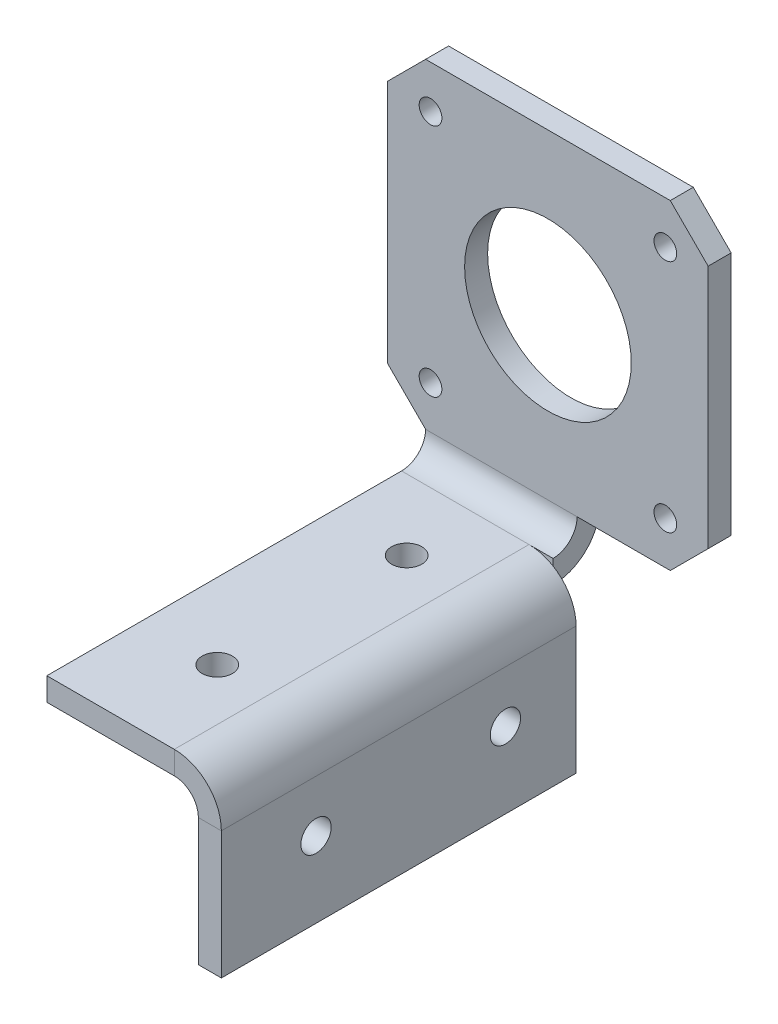
ISO-10303-21;
HEADER;
FILE_DESCRIPTION(('STEP AP214'),'2;1');
FILE_NAME('part.step','',(''),(''),'','','');
FILE_SCHEMA(('AUTOMOTIVE_DESIGN { 1 0 10303 214 1 1 1 1 }'));
ENDSEC;
DATA;
#1=APPLICATION_CONTEXT('core data for automotive mechanical design processes');
#2=APPLICATION_PROTOCOL_DEFINITION('international standard','automotive_design',2000,#1);
#3=PRODUCT_CONTEXT('',#1,'mechanical');
#4=PRODUCT('Part','Part','',(#3));
#5=PRODUCT_RELATED_PRODUCT_CATEGORY('part','',(#4));
#6=PRODUCT_DEFINITION_FORMATION('','',#4);
#7=PRODUCT_DEFINITION_CONTEXT('part definition',#1,'design');
#8=PRODUCT_DEFINITION('design','',#6,#7);
#9=PRODUCT_DEFINITION_SHAPE('','',#8);
#10=(LENGTH_UNIT() NAMED_UNIT(*) SI_UNIT(.MILLI.,.METRE.));
#11=(NAMED_UNIT(*) PLANE_ANGLE_UNIT() SI_UNIT($,.RADIAN.));
#12=(NAMED_UNIT(*) SI_UNIT($,.STERADIAN.) SOLID_ANGLE_UNIT());
#13=UNCERTAINTY_MEASURE_WITH_UNIT(LENGTH_MEASURE(1.E-05),#10,'distance_accuracy_value','');
#14=(GEOMETRIC_REPRESENTATION_CONTEXT(3) GLOBAL_UNCERTAINTY_ASSIGNED_CONTEXT((#13)) GLOBAL_UNIT_ASSIGNED_CONTEXT((#10,
#11,#12)) REPRESENTATION_CONTEXT('',''));
#15=CARTESIAN_POINT('',(0.,0.,0.));
#16=DIRECTION('',(0.,0.,1.));
#17=DIRECTION('',(1.,0.,0.));
#18=AXIS2_PLACEMENT_3D('',#15,#16,#17);
#19=CARTESIAN_POINT('',(31.1366708785734,0.564613687180432,3.17499999999998));
#20=DIRECTION('',(0.,0.,1.));
#21=DIRECTION('',(0.,-1.,0.));
#22=AXIS2_PLACEMENT_3D('',#19,#20,#21);
#23=PLANE('',#22);
#24=DIRECTION('',(1.,0.,0.));
#25=VECTOR('',#24,1.);
#26=CARTESIAN_POINT('',(14.3116708785734,3.60245368718043,3.17499999999999));
#27=LINE('',#26,#25);
#28=CARTESIAN_POINT('',(31.1366708785734,3.60245368718043,3.17499999999999));
#29=VERTEX_POINT('',#28);
#30=CARTESIAN_POINT('',(34.3116708785734,3.60245368718043,3.17499999999999));
#31=VERTEX_POINT('',#30);
#32=EDGE_CURVE('E297',#29,#31,#27,.T.);
#33=ORIENTED_EDGE('',*,*,#32,.F.);
#34=CARTESIAN_POINT('',(31.1366708785734,-2.61038631281957,3.17499999999997));
#35=DIRECTION('',(0.,0.,1.));
#36=DIRECTION('',(0.,-1.,0.));
#37=AXIS2_PLACEMENT_3D('',#34,#35,#36);
#38=CIRCLE('',#37,6.21284);
#39=CARTESIAN_POINT('',(34.3116708785734,2.72990917203893,3.17499999999999));
#40=VERTEX_POINT('',#39);
#41=EDGE_CURVE('E253',#29,#40,#38,.F.);
#42=ORIENTED_EDGE('',*,*,#41,.T.);
#43=DIRECTION('',(0.,1.,0.));
#44=VECTOR('',#43,1.);
#45=CARTESIAN_POINT('',(34.3116708785734,3.60245368718043,3.17499999999999));
#46=LINE('',#45,#44);
#47=EDGE_CURVE('E290',#31,#40,#46,.F.);
#48=ORIENTED_EDGE('',*,*,#47,.F.);
#49=EDGE_LOOP('',(#33,#42,#48));
#50=FACE_BOUND('',#49,.T.);
#51=ADVANCED_FACE('F57',(#50),#23,.T.);
#52=CARTESIAN_POINT('',(0.,0.564613687180438,0.));
#53=DIRECTION('',(0.,1.,0.));
#54=DIRECTION('',(0.,0.,1.));
#55=AXIS2_PLACEMENT_3D('',#52,#53,#54);
#56=PLANE('',#55);
#57=CARTESIAN_POINT('',(24.3116708785734,0.564613687180394,12.5));
#58=DIRECTION('',(0.,1.,0.));
#59=DIRECTION('',(0.,0.,1.));
#60=AXIS2_PLACEMENT_3D('',#57,#58,#59);
#61=CIRCLE('',#60,2.);
#62=CARTESIAN_POINT('',(24.3116708785734,0.564613687180388,14.5));
#63=VERTEX_POINT('',#62);
#64=EDGE_CURVE('E850',#63,#63,#61,.T.);
#65=ORIENTED_EDGE('',*,*,#64,.T.);
#66=EDGE_LOOP('',(#65));
#67=FACE_BOUND('',#66,.T.);
#68=CARTESIAN_POINT('',(24.3116708785734,0.564613687180307,37.5));
#69=DIRECTION('',(0.,1.,0.));
#70=DIRECTION('',(0.,0.,1.));
#71=AXIS2_PLACEMENT_3D('',#68,#69,#70);
#72=CIRCLE('',#71,2.);
#73=CARTESIAN_POINT('',(24.3116708785734,0.5646136871803,39.5));
#74=VERTEX_POINT('',#73);
#75=EDGE_CURVE('E854',#74,#74,#72,.T.);
#76=ORIENTED_EDGE('',*,*,#75,.T.);
#77=EDGE_LOOP('',(#76));
#78=FACE_BOUND('',#77,.T.);
#79=DIRECTION('',(0.,0.,1.));
#80=VECTOR('',#79,1.);
#81=CARTESIAN_POINT('',(31.1366708785734,0.564613687180269,50.));
#82=LINE('',#81,#80);
#83=CARTESIAN_POINT('',(31.1366708785734,0.564613687180269,50.));
#84=VERTEX_POINT('',#83);
#85=CARTESIAN_POINT('',(31.1366708785734,0.564613687180432,3.17499999999998));
#86=VERTEX_POINT('',#85);
#87=EDGE_CURVE('E262',#84,#86,#82,.F.);
#88=ORIENTED_EDGE('',*,*,#87,.F.);
#89=DIRECTION('',(-1.,0.,0.));
#90=VECTOR('',#89,1.);
#91=CARTESIAN_POINT('',(0.,0.564613687180264,50.));
#92=LINE('',#91,#90);
#93=CARTESIAN_POINT('',(14.3116708785734,0.564613687180264,50.));
#94=VERTEX_POINT('',#93);
#95=EDGE_CURVE('E277',#84,#94,#92,.T.);
#96=ORIENTED_EDGE('',*,*,#95,.T.);
#97=DIRECTION('',(0.,0.,-1.));
#98=VECTOR('',#97,1.);
#99=CARTESIAN_POINT('',(14.3116708785734,0.564613687180438,0.));
#100=LINE('',#99,#98);
#101=CARTESIAN_POINT('',(14.3116708785734,0.564613687180427,3.17499999999998));
#102=VERTEX_POINT('',#101);
#103=EDGE_CURVE('E274',#94,#102,#100,.T.);
#104=ORIENTED_EDGE('',*,*,#103,.T.);
#105=DIRECTION('',(1.,0.,0.));
#106=VECTOR('',#105,1.);
#107=CARTESIAN_POINT('',(14.3116708785734,0.564613687180427,3.17499999999998));
#108=LINE('',#107,#106);
#109=EDGE_CURVE('E289',#86,#102,#108,.F.);
#110=ORIENTED_EDGE('',*,*,#109,.F.);
#111=EDGE_LOOP('',(#88,#96,#104,#110));
#112=FACE_BOUND('',#111,.T.);
#113=ADVANCED_FACE('F378',(#67,#78,#112),#56,.F.);
#114=CARTESIAN_POINT('',(0.,3.60245368718044,0.));
#115=DIRECTION('',(0.,1.,0.));
#116=DIRECTION('',(0.,0.,1.));
#117=AXIS2_PLACEMENT_3D('',#114,#115,#116);
#118=PLANE('',#117);
#119=CARTESIAN_POINT('',(24.3116708785734,3.60245368718039,12.5));
#120=DIRECTION('',(0.,1.,0.));
#121=DIRECTION('',(0.,0.,1.));
#122=AXIS2_PLACEMENT_3D('',#119,#120,#121);
#123=CIRCLE('',#122,2.);
#124=CARTESIAN_POINT('',(24.3116708785734,3.60245368718039,14.5));
#125=VERTEX_POINT('',#124);
#126=EDGE_CURVE('E847',#125,#125,#123,.T.);
#127=ORIENTED_EDGE('',*,*,#126,.F.);
#128=EDGE_LOOP('',(#127));
#129=FACE_BOUND('',#128,.T.);
#130=CARTESIAN_POINT('',(24.3116708785734,3.60245368718031,37.5));
#131=DIRECTION('',(0.,1.,0.));
#132=DIRECTION('',(0.,0.,1.));
#133=AXIS2_PLACEMENT_3D('',#130,#131,#132);
#134=CIRCLE('',#133,2.);
#135=CARTESIAN_POINT('',(24.3116708785734,3.6024536871803,39.5));
#136=VERTEX_POINT('',#135);
#137=EDGE_CURVE('E851',#136,#136,#134,.T.);
#138=ORIENTED_EDGE('',*,*,#137,.F.);
#139=EDGE_LOOP('',(#138));
#140=FACE_BOUND('',#139,.T.);
#141=DIRECTION('',(1.,0.,0.));
#142=VECTOR('',#141,1.);
#143=CARTESIAN_POINT('',(14.3116708785734,3.60245368718026,50.));
#144=LINE('',#143,#142);
#145=CARTESIAN_POINT('',(31.1366708785734,3.60245368718027,50.));
#146=VERTEX_POINT('',#145);
#147=CARTESIAN_POINT('',(14.3116708785734,3.60245368718026,50.));
#148=VERTEX_POINT('',#147);
#149=EDGE_CURVE('E283',#146,#148,#144,.F.);
#150=ORIENTED_EDGE('',*,*,#149,.F.);
#151=DIRECTION('',(0.,0.,1.));
#152=VECTOR('',#151,1.);
#153=CARTESIAN_POINT('',(31.1366708785734,3.60245368718027,50.));
#154=LINE('',#153,#152);
#155=EDGE_CURVE('E248',#146,#29,#154,.F.);
#156=ORIENTED_EDGE('',*,*,#155,.T.);
#157=CARTESIAN_POINT('',(14.3116708785734,3.60245368718043,3.17499999999999));
#158=VERTEX_POINT('',#157);
#159=EDGE_CURVE('E294',#158,#29,#27,.T.);
#160=ORIENTED_EDGE('',*,*,#159,.F.);
#161=DIRECTION('',(0.,0.,1.));
#162=VECTOR('',#161,1.);
#163=CARTESIAN_POINT('',(14.3116708785734,3.60245368718044,0.));
#164=LINE('',#163,#162);
#165=EDGE_CURVE('E280',#148,#158,#164,.F.);
#166=ORIENTED_EDGE('',*,*,#165,.F.);
#167=EDGE_LOOP('',(#150,#156,#160,#166));
#168=FACE_BOUND('',#167,.T.);
#169=ADVANCED_FACE('F391',(#129,#140,#168),#118,.T.);
#170=CARTESIAN_POINT('',(14.3116708785734,0.564613687180264,50.));
#171=DIRECTION('',(0.,0.,-1.));
#172=DIRECTION('',(0.,1.,0.));
#173=AXIS2_PLACEMENT_3D('',#170,#171,#172);
#174=PLANE('',#173);
#175=DIRECTION('',(0.,1.,0.));
#176=VECTOR('',#175,1.);
#177=CARTESIAN_POINT('',(31.1366708785734,0.564613687180269,50.));
#178=LINE('',#177,#176);
#179=EDGE_CURVE('E256',#84,#146,#178,.T.);
#180=ORIENTED_EDGE('',*,*,#179,.T.);
#181=ORIENTED_EDGE('',*,*,#149,.T.);
#182=DIRECTION('',(0.,1.,0.));
#183=VECTOR('',#182,1.);
#184=CARTESIAN_POINT('',(14.3116708785734,0.564613687180263,50.));
#185=LINE('',#184,#183);
#186=EDGE_CURVE('E270',#94,#148,#185,.T.);
#187=ORIENTED_EDGE('',*,*,#186,.F.);
#188=ORIENTED_EDGE('',*,*,#95,.F.);
#189=EDGE_LOOP('',(#180,#181,#187,#188));
#190=FACE_BOUND('',#189,.T.);
#191=ADVANCED_FACE('F386',(#190),#174,.F.);
#192=CARTESIAN_POINT('',(34.3116708785734,6.77745368718043,-3.03784));
#193=DIRECTION('',(0.,-1.,0.));
#194=DIRECTION('',(0.,0.,-1.));
#195=AXIS2_PLACEMENT_3D('',#192,#193,#194);
#196=PLANE('',#195);
#197=DIRECTION('',(1.,0.,0.));
#198=VECTOR('',#197,1.);
#199=CARTESIAN_POINT('',(34.3116708785734,6.77745368718043,0.));
#200=LINE('',#199,#198);
#201=CARTESIAN_POINT('',(34.3116708785734,6.77745368718043,0.));
#202=VERTEX_POINT('',#201);
#203=CARTESIAN_POINT('',(46.6116708785734,6.77745368718043,0.));
#204=VERTEX_POINT('',#203);
#205=EDGE_CURVE('E177',#202,#204,#200,.T.);
#206=ORIENTED_EDGE('',*,*,#205,.F.);
#207=DIRECTION('',(0.,0.,-1.));
#208=VECTOR('',#207,1.);
#209=CARTESIAN_POINT('',(34.3116708785734,6.77745368718043,0.));
#210=LINE('',#209,#208);
#211=CARTESIAN_POINT('',(34.3116708785734,6.77745368718043,-3.03784));
#212=VERTEX_POINT('',#211);
#213=EDGE_CURVE('E303',#202,#212,#210,.T.);
#214=ORIENTED_EDGE('',*,*,#213,.T.);
#215=DIRECTION('',(1.,0.,0.));
#216=VECTOR('',#215,1.);
#217=CARTESIAN_POINT('',(14.3116708785734,6.77745368718043,-3.03784));
#218=LINE('',#217,#216);
#219=CARTESIAN_POINT('',(46.6116708785734,6.77745368718043,-3.03784));
#220=VERTEX_POINT('',#219);
#221=EDGE_CURVE('E159',#212,#220,#218,.T.);
#222=ORIENTED_EDGE('',*,*,#221,.T.);
#223=DIRECTION('',(0.,0.,1.));
#224=VECTOR('',#223,1.);
#225=CARTESIAN_POINT('',(46.6116708785734,6.77745368718043,-3.03784));
#226=LINE('',#225,#224);
#227=EDGE_CURVE('E145',#220,#204,#226,.T.);
#228=ORIENTED_EDGE('',*,*,#227,.T.);
#229=EDGE_LOOP('',(#206,#214,#222,#228));
#230=FACE_BOUND('',#229,.T.);
#231=ADVANCED_FACE('F352',(#230),#196,.T.);
#232=CARTESIAN_POINT('',(14.3116708785734,49.0774536871804,-3.03784));
#233=DIRECTION('',(0.,1.,0.));
#234=DIRECTION('',(0.,0.,1.));
#235=AXIS2_PLACEMENT_3D('',#232,#233,#234);
#236=PLANE('',#235);
#237=DIRECTION('',(-1.,0.,0.));
#238=VECTOR('',#237,1.);
#239=CARTESIAN_POINT('',(14.3116708785734,49.0774536871804,0.));
#240=LINE('',#239,#238);
#241=CARTESIAN_POINT('',(46.6116708785734,49.0774536871804,0.));
#242=VERTEX_POINT('',#241);
#243=CARTESIAN_POINT('',(14.3116708785734,49.0774536871804,0.));
#244=VERTEX_POINT('',#243);
#245=EDGE_CURVE('E164',#242,#244,#240,.T.);
#246=ORIENTED_EDGE('',*,*,#245,.F.);
#247=DIRECTION('',(0.,0.,1.));
#248=VECTOR('',#247,1.);
#249=CARTESIAN_POINT('',(46.6116708785734,49.0774536871804,-3.03784));
#250=LINE('',#249,#248);
#251=CARTESIAN_POINT('',(46.6116708785734,49.0774536871804,-3.03784));
#252=VERTEX_POINT('',#251);
#253=EDGE_CURVE('E13',#252,#242,#250,.T.);
#254=ORIENTED_EDGE('',*,*,#253,.F.);
#255=DIRECTION('',(-1.,0.,0.));
#256=VECTOR('',#255,1.);
#257=CARTESIAN_POINT('',(14.3116708785734,49.0774536871804,-3.03784));
#258=LINE('',#257,#256);
#259=CARTESIAN_POINT('',(14.3116708785734,49.0774536871804,-3.03784));
#260=VERTEX_POINT('',#259);
#261=EDGE_CURVE('E186',#252,#260,#258,.T.);
#262=ORIENTED_EDGE('',*,*,#261,.T.);
#263=DIRECTION('',(0.,0.,1.));
#264=VECTOR('',#263,1.);
#265=CARTESIAN_POINT('',(14.3116708785734,49.0774536871804,-3.03784));
#266=LINE('',#265,#264);
#267=EDGE_CURVE('E117',#260,#244,#266,.T.);
#268=ORIENTED_EDGE('',*,*,#267,.T.);
#269=EDGE_LOOP('',(#246,#254,#262,#268));
#270=FACE_BOUND('',#269,.T.);
#271=ADVANCED_FACE('F59',(#270),#236,.T.);
#272=CARTESIAN_POINT('',(46.6116708785734,49.0774536871804,-3.03784));
#273=DIRECTION('',(0.707106781186548,0.707106781186547,0.));
#274=DIRECTION('',(-0.707106781186547,0.707106781186548,0.));
#275=AXIS2_PLACEMENT_3D('',#272,#273,#274);
#276=PLANE('',#275);
#277=DIRECTION('',(-0.707106781186547,0.707106781186548,0.));
#278=VECTOR('',#277,1.);
#279=CARTESIAN_POINT('',(46.6116708785734,49.0774536871804,0.));
#280=LINE('',#279,#278);
#281=CARTESIAN_POINT('',(51.6116708785734,44.0774536871804,0.));
#282=VERTEX_POINT('',#281);
#283=EDGE_CURVE('E184',#282,#242,#280,.T.);
#284=ORIENTED_EDGE('',*,*,#283,.F.);
#285=DIRECTION('',(0.,0.,1.));
#286=VECTOR('',#285,1.);
#287=CARTESIAN_POINT('',(51.6116708785734,44.0774536871804,-3.03784));
#288=LINE('',#287,#286);
#289=CARTESIAN_POINT('',(51.6116708785734,44.0774536871804,-3.03784));
#290=VERTEX_POINT('',#289);
#291=EDGE_CURVE('E66',#290,#282,#288,.T.);
#292=ORIENTED_EDGE('',*,*,#291,.F.);
#293=DIRECTION('',(-0.707106781186547,0.707106781186548,0.));
#294=VECTOR('',#293,1.);
#295=CARTESIAN_POINT('',(46.6116708785734,49.0774536871804,-3.03784));
#296=LINE('',#295,#294);
#297=EDGE_CURVE('E152',#290,#252,#296,.T.);
#298=ORIENTED_EDGE('',*,*,#297,.T.);
#299=ORIENTED_EDGE('',*,*,#253,.T.);
#300=EDGE_LOOP('',(#284,#292,#298,#299));
#301=FACE_BOUND('',#300,.T.);
#302=ADVANCED_FACE('F428',(#301),#276,.T.);
#303=CARTESIAN_POINT('',(51.6116708785734,11.7774536871804,-3.03784));
#304=DIRECTION('',(1.,0.,0.));
#305=DIRECTION('',(0.,0.,-1.));
#306=AXIS2_PLACEMENT_3D('',#303,#304,#305);
#307=PLANE('',#306);
#308=DIRECTION('',(0.,1.,0.));
#309=VECTOR('',#308,1.);
#310=CARTESIAN_POINT('',(51.6116708785734,11.7774536871804,0.));
#311=LINE('',#310,#309);
#312=CARTESIAN_POINT('',(51.6116708785734,11.7774536871804,0.));
#313=VERTEX_POINT('',#312);
#314=EDGE_CURVE('E140',#313,#282,#311,.T.);
#315=ORIENTED_EDGE('',*,*,#314,.F.);
#316=DIRECTION('',(0.,0.,1.));
#317=VECTOR('',#316,1.);
#318=CARTESIAN_POINT('',(51.6116708785734,11.7774536871804,-3.03784));
#319=LINE('',#318,#317);
#320=CARTESIAN_POINT('',(51.6116708785734,11.7774536871804,-3.03784));
#321=VERTEX_POINT('',#320);
#322=EDGE_CURVE('E134',#321,#313,#319,.T.);
#323=ORIENTED_EDGE('',*,*,#322,.F.);
#324=DIRECTION('',(0.,1.,0.));
#325=VECTOR('',#324,1.);
#326=CARTESIAN_POINT('',(51.6116708785734,11.7774536871804,-3.03784));
#327=LINE('',#326,#325);
#328=EDGE_CURVE('E137',#321,#290,#327,.T.);
#329=ORIENTED_EDGE('',*,*,#328,.T.);
#330=ORIENTED_EDGE('',*,*,#291,.T.);
#331=EDGE_LOOP('',(#315,#323,#329,#330));
#332=FACE_BOUND('',#331,.T.);
#333=ADVANCED_FACE('F136',(#332),#307,.T.);
#334=CARTESIAN_POINT('',(46.6116708785734,6.77745368718043,-3.03784));
#335=DIRECTION('',(0.707106781186548,-0.707106781186547,0.));
#336=DIRECTION('',(0.707106781186547,0.707106781186548,0.));
#337=AXIS2_PLACEMENT_3D('',#334,#335,#336);
#338=PLANE('',#337);
#339=DIRECTION('',(0.707106781186547,0.707106781186548,0.));
#340=VECTOR('',#339,1.);
#341=CARTESIAN_POINT('',(46.6116708785734,6.77745368718043,0.));
#342=LINE('',#341,#340);
#343=EDGE_CURVE('E181',#204,#313,#342,.T.);
#344=ORIENTED_EDGE('',*,*,#343,.F.);
#345=ORIENTED_EDGE('',*,*,#227,.F.);
#346=DIRECTION('',(0.707106781186547,0.707106781186548,0.));
#347=VECTOR('',#346,1.);
#348=CARTESIAN_POINT('',(46.6116708785734,6.77745368718043,-3.03784));
#349=LINE('',#348,#347);
#350=EDGE_CURVE('E151',#220,#321,#349,.T.);
#351=ORIENTED_EDGE('',*,*,#350,.T.);
#352=ORIENTED_EDGE('',*,*,#322,.T.);
#353=EDGE_LOOP('',(#344,#345,#351,#352));
#354=FACE_BOUND('',#353,.T.);
#355=ADVANCED_FACE('F155',(#354),#338,.T.);
#356=CARTESIAN_POINT('',(14.3116708785734,6.77745368718043,-3.03784));
#357=DIRECTION('',(-0.707106781186548,-0.707106781186548,0.));
#358=DIRECTION('',(0.707106781186548,-0.707106781186548,0.));
#359=AXIS2_PLACEMENT_3D('',#356,#357,#358);
#360=PLANE('',#359);
#361=DIRECTION('',(0.707106781186548,-0.707106781186548,0.));
#362=VECTOR('',#361,1.);
#363=CARTESIAN_POINT('',(14.3116708785734,6.77745368718043,0.));
#364=LINE('',#363,#362);
#365=CARTESIAN_POINT('',(9.31167087857342,11.7774536871804,0.));
#366=VERTEX_POINT('',#365);
#367=CARTESIAN_POINT('',(14.3116708785734,6.77745368718043,0.));
#368=VERTEX_POINT('',#367);
#369=EDGE_CURVE('E174',#366,#368,#364,.T.);
#370=ORIENTED_EDGE('',*,*,#369,.F.);
#371=DIRECTION('',(0.,0.,1.));
#372=VECTOR('',#371,1.);
#373=CARTESIAN_POINT('',(9.31167087857342,11.7774536871804,-3.03784));
#374=LINE('',#373,#372);
#375=CARTESIAN_POINT('',(9.31167087857342,11.7774536871804,-3.03784));
#376=VERTEX_POINT('',#375);
#377=EDGE_CURVE('E193',#376,#366,#374,.T.);
#378=ORIENTED_EDGE('',*,*,#377,.F.);
#379=DIRECTION('',(0.707106781186548,-0.707106781186548,0.));
#380=VECTOR('',#379,1.);
#381=CARTESIAN_POINT('',(14.3116708785734,6.77745368718043,-3.03784));
#382=LINE('',#381,#380);
#383=CARTESIAN_POINT('',(14.3116708785734,6.77745368718043,-3.03784));
#384=VERTEX_POINT('',#383);
#385=EDGE_CURVE('E346',#376,#384,#382,.T.);
#386=ORIENTED_EDGE('',*,*,#385,.T.);
#387=DIRECTION('',(0.,0.,1.));
#388=VECTOR('',#387,1.);
#389=CARTESIAN_POINT('',(14.3116708785734,6.77745368718043,-3.03784));
#390=LINE('',#389,#388);
#391=EDGE_CURVE('E190',#384,#368,#390,.T.);
#392=ORIENTED_EDGE('',*,*,#391,.T.);
#393=EDGE_LOOP('',(#370,#378,#386,#392));
#394=FACE_BOUND('',#393,.T.);
#395=ADVANCED_FACE('F424',(#394),#360,.T.);
#396=CARTESIAN_POINT('',(9.31167087857342,11.7774536871804,-3.03784));
#397=DIRECTION('',(-1.,0.,0.));
#398=DIRECTION('',(0.,0.,1.));
#399=AXIS2_PLACEMENT_3D('',#396,#397,#398);
#400=PLANE('',#399);
#401=DIRECTION('',(0.,-1.,0.));
#402=VECTOR('',#401,1.);
#403=CARTESIAN_POINT('',(9.31167087857342,11.7774536871804,0.));
#404=LINE('',#403,#402);
#405=CARTESIAN_POINT('',(9.31167087857342,44.0774536871804,0.));
#406=VERTEX_POINT('',#405);
#407=EDGE_CURVE('E171',#406,#366,#404,.T.);
#408=ORIENTED_EDGE('',*,*,#407,.F.);
#409=DIRECTION('',(0.,0.,1.));
#410=VECTOR('',#409,1.);
#411=CARTESIAN_POINT('',(9.31167087857342,44.0774536871804,-3.03784));
#412=LINE('',#411,#410);
#413=CARTESIAN_POINT('',(9.31167087857342,44.0774536871804,-3.03784));
#414=VERTEX_POINT('',#413);
#415=EDGE_CURVE('E195',#414,#406,#412,.T.);
#416=ORIENTED_EDGE('',*,*,#415,.F.);
#417=DIRECTION('',(0.,-1.,0.));
#418=VECTOR('',#417,1.);
#419=CARTESIAN_POINT('',(9.31167087857342,11.7774536871804,-3.03784));
#420=LINE('',#419,#418);
#421=EDGE_CURVE('E344',#414,#376,#420,.T.);
#422=ORIENTED_EDGE('',*,*,#421,.T.);
#423=ORIENTED_EDGE('',*,*,#377,.T.);
#424=EDGE_LOOP('',(#408,#416,#422,#423));
#425=FACE_BOUND('',#424,.T.);
#426=ADVANCED_FACE('F426',(#425),#400,.T.);
#427=CARTESIAN_POINT('',(9.31167087857342,44.0774536871804,-3.03784));
#428=DIRECTION('',(-0.707106781186547,0.707106781186548,0.));
#429=DIRECTION('',(-0.707106781186548,-0.707106781186547,0.));
#430=AXIS2_PLACEMENT_3D('',#427,#428,#429);
#431=PLANE('',#430);
#432=DIRECTION('',(-0.707106781186548,-0.707106781186547,0.));
#433=VECTOR('',#432,1.);
#434=CARTESIAN_POINT('',(9.31167087857342,44.0774536871804,0.));
#435=LINE('',#434,#433);
#436=EDGE_CURVE('E167',#244,#406,#435,.T.);
#437=ORIENTED_EDGE('',*,*,#436,.F.);
#438=ORIENTED_EDGE('',*,*,#267,.F.);
#439=DIRECTION('',(-0.707106781186548,-0.707106781186547,0.));
#440=VECTOR('',#439,1.);
#441=CARTESIAN_POINT('',(9.31167087857342,44.0774536871804,-3.03784));
#442=LINE('',#441,#440);
#443=EDGE_CURVE('E342',#260,#414,#442,.T.);
#444=ORIENTED_EDGE('',*,*,#443,.T.);
#445=ORIENTED_EDGE('',*,*,#415,.T.);
#446=EDGE_LOOP('',(#437,#438,#444,#445));
#447=FACE_BOUND('',#446,.T.);
#448=ADVANCED_FACE('F427',(#447),#431,.T.);
#449=CARTESIAN_POINT('',(0.,0.,-3.03784));
#450=DIRECTION('',(0.,0.,1.));
#451=DIRECTION('',(1.,0.,0.));
#452=AXIS2_PLACEMENT_3D('',#449,#450,#451);
#453=PLANE('',#452);
#454=CARTESIAN_POINT('',(30.4616708785734,27.9274536871804,-3.03784));
#455=DIRECTION('',(0.,0.,1.));
#456=DIRECTION('',(1.,0.,0.));
#457=AXIS2_PLACEMENT_3D('',#454,#455,#456);
#458=CIRCLE('',#457,11.);
#459=CARTESIAN_POINT('',(41.4616708785734,27.9274536871804,-3.03784));
#460=VERTEX_POINT('',#459);
#461=EDGE_CURVE('E313',#460,#460,#458,.T.);
#462=ORIENTED_EDGE('',*,*,#461,.T.);
#463=EDGE_LOOP('',(#462));
#464=FACE_BOUND('',#463,.T.);
#465=CARTESIAN_POINT('',(45.9616708785734,43.4274536871804,-3.03784));
#466=DIRECTION('',(0.,0.,1.));
#467=DIRECTION('',(1.,0.,0.));
#468=AXIS2_PLACEMENT_3D('',#465,#466,#467);
#469=CIRCLE('',#468,1.5);
#470=CARTESIAN_POINT('',(47.4616708785734,43.4274536871804,-3.03784));
#471=VERTEX_POINT('',#470);
#472=EDGE_CURVE('E319',#471,#471,#469,.T.);
#473=ORIENTED_EDGE('',*,*,#472,.T.);
#474=EDGE_LOOP('',(#473));
#475=FACE_BOUND('',#474,.T.);
#476=CARTESIAN_POINT('',(45.9616708785734,12.4274536871804,-3.03784));
#477=DIRECTION('',(0.,0.,1.));
#478=DIRECTION('',(1.,0.,0.));
#479=AXIS2_PLACEMENT_3D('',#476,#477,#478);
#480=CIRCLE('',#479,1.5);
#481=CARTESIAN_POINT('',(47.4616708785734,12.4274536871804,-3.03784));
#482=VERTEX_POINT('',#481);
#483=EDGE_CURVE('E325',#482,#482,#480,.T.);
#484=ORIENTED_EDGE('',*,*,#483,.T.);
#485=EDGE_LOOP('',(#484));
#486=FACE_BOUND('',#485,.T.);
#487=CARTESIAN_POINT('',(14.9616708785734,12.4274536871804,-3.03784));
#488=DIRECTION('',(0.,0.,1.));
#489=DIRECTION('',(1.,0.,0.));
#490=AXIS2_PLACEMENT_3D('',#487,#488,#489);
#491=CIRCLE('',#490,1.5);
#492=CARTESIAN_POINT('',(16.4616708785734,12.4274536871804,-3.03784));
#493=VERTEX_POINT('',#492);
#494=EDGE_CURVE('E331',#493,#493,#491,.T.);
#495=ORIENTED_EDGE('',*,*,#494,.T.);
#496=EDGE_LOOP('',(#495));
#497=FACE_BOUND('',#496,.T.);
#498=CARTESIAN_POINT('',(14.9616708785734,43.4274536871804,-3.03784));
#499=DIRECTION('',(0.,0.,1.));
#500=DIRECTION('',(1.,0.,0.));
#501=AXIS2_PLACEMENT_3D('',#498,#499,#500);
#502=CIRCLE('',#501,1.5);
#503=CARTESIAN_POINT('',(16.4616708785734,43.4274536871804,-3.03784));
#504=VERTEX_POINT('',#503);
#505=EDGE_CURVE('E168',#504,#504,#502,.T.);
#506=ORIENTED_EDGE('',*,*,#505,.T.);
#507=EDGE_LOOP('',(#506));
#508=FACE_BOUND('',#507,.T.);
#509=ORIENTED_EDGE('',*,*,#261,.F.);
#510=ORIENTED_EDGE('',*,*,#297,.F.);
#511=ORIENTED_EDGE('',*,*,#328,.F.);
#512=ORIENTED_EDGE('',*,*,#350,.F.);
#513=ORIENTED_EDGE('',*,*,#221,.F.);
#514=EDGE_CURVE('E157',#384,#212,#218,.T.);
#515=ORIENTED_EDGE('',*,*,#514,.F.);
#516=ORIENTED_EDGE('',*,*,#385,.F.);
#517=ORIENTED_EDGE('',*,*,#421,.F.);
#518=ORIENTED_EDGE('',*,*,#443,.F.);
#519=EDGE_LOOP('',(#509,#510,#511,#512,#513,#515,#516,#517,#518));
#520=FACE_BOUND('',#519,.T.);
#521=ADVANCED_FACE('F149',(#464,#475,#486,#497,#508,#520),#453,.F.);
#522=CARTESIAN_POINT('',(0.,0.,0.));
#523=DIRECTION('',(0.,0.,1.));
#524=DIRECTION('',(1.,0.,0.));
#525=AXIS2_PLACEMENT_3D('',#522,#523,#524);
#526=PLANE('',#525);
#527=CARTESIAN_POINT('',(30.4616708785734,27.9274536871804,0.));
#528=DIRECTION('',(0.,0.,1.));
#529=DIRECTION('',(1.,0.,0.));
#530=AXIS2_PLACEMENT_3D('',#527,#528,#529);
#531=CIRCLE('',#530,11.);
#532=CARTESIAN_POINT('',(41.4616708785734,27.9274536871804,0.));
#533=VERTEX_POINT('',#532);
#534=EDGE_CURVE('E312',#533,#533,#531,.T.);
#535=ORIENTED_EDGE('',*,*,#534,.F.);
#536=EDGE_LOOP('',(#535));
#537=FACE_BOUND('',#536,.T.);
#538=CARTESIAN_POINT('',(45.9616708785734,43.4274536871804,0.));
#539=DIRECTION('',(0.,0.,1.));
#540=DIRECTION('',(1.,0.,0.));
#541=AXIS2_PLACEMENT_3D('',#538,#539,#540);
#542=CIRCLE('',#541,1.5);
#543=CARTESIAN_POINT('',(47.4616708785734,43.4274536871804,0.));
#544=VERTEX_POINT('',#543);
#545=EDGE_CURVE('E316',#544,#544,#542,.T.);
#546=ORIENTED_EDGE('',*,*,#545,.F.);
#547=EDGE_LOOP('',(#546));
#548=FACE_BOUND('',#547,.T.);
#549=CARTESIAN_POINT('',(45.9616708785734,12.4274536871804,0.));
#550=DIRECTION('',(0.,0.,1.));
#551=DIRECTION('',(1.,0.,0.));
#552=AXIS2_PLACEMENT_3D('',#549,#550,#551);
#553=CIRCLE('',#552,1.5);
#554=CARTESIAN_POINT('',(47.4616708785734,12.4274536871804,0.));
#555=VERTEX_POINT('',#554);
#556=EDGE_CURVE('E322',#555,#555,#553,.T.);
#557=ORIENTED_EDGE('',*,*,#556,.F.);
#558=EDGE_LOOP('',(#557));
#559=FACE_BOUND('',#558,.T.);
#560=CARTESIAN_POINT('',(14.9616708785734,12.4274536871804,0.));
#561=DIRECTION('',(0.,0.,1.));
#562=DIRECTION('',(1.,0.,0.));
#563=AXIS2_PLACEMENT_3D('',#560,#561,#562);
#564=CIRCLE('',#563,1.5);
#565=CARTESIAN_POINT('',(16.4616708785734,12.4274536871804,0.));
#566=VERTEX_POINT('',#565);
#567=EDGE_CURVE('E328',#566,#566,#564,.T.);
#568=ORIENTED_EDGE('',*,*,#567,.F.);
#569=EDGE_LOOP('',(#568));
#570=FACE_BOUND('',#569,.T.);
#571=CARTESIAN_POINT('',(14.9616708785734,43.4274536871804,0.));
#572=DIRECTION('',(0.,0.,1.));
#573=DIRECTION('',(1.,0.,0.));
#574=AXIS2_PLACEMENT_3D('',#571,#572,#573);
#575=CIRCLE('',#574,1.5);
#576=CARTESIAN_POINT('',(16.4616708785734,43.4274536871804,0.));
#577=VERTEX_POINT('',#576);
#578=EDGE_CURVE('E334',#577,#577,#575,.T.);
#579=ORIENTED_EDGE('',*,*,#578,.F.);
#580=EDGE_LOOP('',(#579));
#581=FACE_BOUND('',#580,.T.);
#582=ORIENTED_EDGE('',*,*,#245,.T.);
#583=ORIENTED_EDGE('',*,*,#436,.T.);
#584=ORIENTED_EDGE('',*,*,#407,.T.);
#585=ORIENTED_EDGE('',*,*,#369,.T.);
#586=EDGE_CURVE('E178',#368,#202,#200,.T.);
#587=ORIENTED_EDGE('',*,*,#586,.T.);
#588=ORIENTED_EDGE('',*,*,#205,.T.);
#589=ORIENTED_EDGE('',*,*,#343,.T.);
#590=ORIENTED_EDGE('',*,*,#314,.T.);
#591=ORIENTED_EDGE('',*,*,#283,.T.);
#592=EDGE_LOOP('',(#582,#583,#584,#585,#587,#588,#589,#590,#591));
#593=FACE_BOUND('',#592,.T.);
#594=ADVANCED_FACE('F421',(#537,#548,#559,#570,#581,#593),#526,.T.);
#595=CARTESIAN_POINT('',(14.9616708785734,43.4274536871804,-3.03784));
#596=DIRECTION('',(0.,0.,1.));
#597=DIRECTION('',(1.,0.,0.));
#598=AXIS2_PLACEMENT_3D('',#595,#596,#597);
#599=CYLINDRICAL_SURFACE('',#598,1.5);
#600=ORIENTED_EDGE('',*,*,#505,.F.);
#601=EDGE_LOOP('',(#600));
#602=FACE_BOUND('',#601,.T.);
#603=ORIENTED_EDGE('',*,*,#578,.T.);
#604=EDGE_LOOP('',(#603));
#605=FACE_BOUND('',#604,.T.);
#606=ADVANCED_FACE('F479',(#602,#605),#599,.F.);
#607=CARTESIAN_POINT('',(14.9616708785734,12.4274536871804,-3.03784));
#608=DIRECTION('',(0.,0.,1.));
#609=DIRECTION('',(1.,0.,0.));
#610=AXIS2_PLACEMENT_3D('',#607,#608,#609);
#611=CYLINDRICAL_SURFACE('',#610,1.5);
#612=ORIENTED_EDGE('',*,*,#494,.F.);
#613=EDGE_LOOP('',(#612));
#614=FACE_BOUND('',#613,.T.);
#615=ORIENTED_EDGE('',*,*,#567,.T.);
#616=EDGE_LOOP('',(#615));
#617=FACE_BOUND('',#616,.T.);
#618=ADVANCED_FACE('F475',(#614,#617),#611,.F.);
#619=CARTESIAN_POINT('',(45.9616708785734,12.4274536871804,-3.03784));
#620=DIRECTION('',(0.,0.,1.));
#621=DIRECTION('',(1.,0.,0.));
#622=AXIS2_PLACEMENT_3D('',#619,#620,#621);
#623=CYLINDRICAL_SURFACE('',#622,1.5);
#624=ORIENTED_EDGE('',*,*,#483,.F.);
#625=EDGE_LOOP('',(#624));
#626=FACE_BOUND('',#625,.T.);
#627=ORIENTED_EDGE('',*,*,#556,.T.);
#628=EDGE_LOOP('',(#627));
#629=FACE_BOUND('',#628,.T.);
#630=ADVANCED_FACE('F471',(#626,#629),#623,.F.);
#631=CARTESIAN_POINT('',(45.9616708785734,43.4274536871804,-3.03784));
#632=DIRECTION('',(0.,0.,1.));
#633=DIRECTION('',(1.,0.,0.));
#634=AXIS2_PLACEMENT_3D('',#631,#632,#633);
#635=CYLINDRICAL_SURFACE('',#634,1.5);
#636=ORIENTED_EDGE('',*,*,#472,.F.);
#637=EDGE_LOOP('',(#636));
#638=FACE_BOUND('',#637,.T.);
#639=ORIENTED_EDGE('',*,*,#545,.T.);
#640=EDGE_LOOP('',(#639));
#641=FACE_BOUND('',#640,.T.);
#642=ADVANCED_FACE('F467',(#638,#641),#635,.F.);
#643=CARTESIAN_POINT('',(30.4616708785734,27.9274536871804,-3.03784));
#644=DIRECTION('',(0.,0.,1.));
#645=DIRECTION('',(1.,0.,0.));
#646=AXIS2_PLACEMENT_3D('',#643,#644,#645);
#647=CYLINDRICAL_SURFACE('',#646,11.);
#648=ORIENTED_EDGE('',*,*,#461,.F.);
#649=EDGE_LOOP('',(#648));
#650=FACE_BOUND('',#649,.T.);
#651=ORIENTED_EDGE('',*,*,#534,.T.);
#652=EDGE_LOOP('',(#651));
#653=FACE_BOUND('',#652,.T.);
#654=ADVANCED_FACE('F462',(#650,#653),#647,.F.);
#655=CARTESIAN_POINT('',(14.3116708785734,6.77745368718043,3.175));
#656=DIRECTION('',(-1.,0.,0.));
#657=DIRECTION('',(0.,0.,1.));
#658=AXIS2_PLACEMENT_3D('',#655,#656,#657);
#659=PLANE('',#658);
#660=DIRECTION('',(0.,1.,0.));
#661=VECTOR('',#660,1.);
#662=CARTESIAN_POINT('',(14.3116708785734,0.564613687180427,3.17499999999998));
#663=LINE('',#662,#661);
#664=EDGE_CURVE('E269',#158,#102,#663,.F.);
#665=ORIENTED_EDGE('',*,*,#664,.F.);
#666=CARTESIAN_POINT('',(14.3116708785734,6.77745368718043,3.175));
#667=DIRECTION('',(1.,0.,0.));
#668=DIRECTION('',(0.,0.,-1.));
#669=AXIS2_PLACEMENT_3D('',#666,#667,#668);
#670=CIRCLE('',#669,3.175);
#671=EDGE_CURVE('E305',#368,#158,#670,.F.);
#672=ORIENTED_EDGE('',*,*,#671,.F.);
#673=ORIENTED_EDGE('',*,*,#391,.F.);
#674=CARTESIAN_POINT('',(14.3116708785734,6.77745368718043,3.175));
#675=DIRECTION('',(1.,0.,0.));
#676=DIRECTION('',(0.,0.,-1.));
#677=AXIS2_PLACEMENT_3D('',#674,#675,#676);
#678=CIRCLE('',#677,6.21284);
#679=EDGE_CURVE('E300',#384,#102,#678,.F.);
#680=ORIENTED_EDGE('',*,*,#679,.T.);
#681=EDGE_LOOP('',(#665,#672,#673,#680));
#682=FACE_BOUND('',#681,.T.);
#683=ADVANCED_FACE('F366',(#682),#659,.T.);
#684=CARTESIAN_POINT('',(34.3116708785734,6.77745368718043,3.175));
#685=DIRECTION('',(-1.,0.,0.));
#686=DIRECTION('',(0.,0.,1.));
#687=AXIS2_PLACEMENT_3D('',#684,#685,#686);
#688=PLANE('',#687);
#689=CARTESIAN_POINT('',(34.3116708785734,6.77745368718043,3.175));
#690=DIRECTION('',(1.,0.,0.));
#691=DIRECTION('',(0.,0.,-1.));
#692=AXIS2_PLACEMENT_3D('',#689,#690,#691);
#693=CIRCLE('',#692,3.175);
#694=EDGE_CURVE('E273',#31,#202,#693,.T.);
#695=ORIENTED_EDGE('',*,*,#694,.F.);
#696=ORIENTED_EDGE('',*,*,#47,.T.);
#697=CARTESIAN_POINT('',(34.3116708785734,0.564613687180427,3.17499999999998));
#698=VERTEX_POINT('',#697);
#699=EDGE_CURVE('E293',#40,#698,#46,.F.);
#700=ORIENTED_EDGE('',*,*,#699,.T.);
#701=CARTESIAN_POINT('',(34.3116708785734,6.77745368718043,3.175));
#702=DIRECTION('',(1.,0.,0.));
#703=DIRECTION('',(0.,0.,-1.));
#704=AXIS2_PLACEMENT_3D('',#701,#702,#703);
#705=CIRCLE('',#704,6.21284);
#706=EDGE_CURVE('E74',#698,#212,#705,.T.);
#707=ORIENTED_EDGE('',*,*,#706,.T.);
#708=ORIENTED_EDGE('',*,*,#213,.F.);
#709=EDGE_LOOP('',(#695,#696,#700,#707,#708));
#710=FACE_BOUND('',#709,.T.);
#711=ADVANCED_FACE('F407',(#710),#688,.F.);
#712=CARTESIAN_POINT('',(34.3116708785734,6.77745368718043,3.175));
#713=DIRECTION('',(1.,0.,0.));
#714=DIRECTION('',(0.,-1.,0.));
#715=AXIS2_PLACEMENT_3D('',#712,#713,#714);
#716=CYLINDRICAL_SURFACE('',#715,6.21284);
#717=ORIENTED_EDGE('',*,*,#514,.T.);
#718=ORIENTED_EDGE('',*,*,#706,.F.);
#719=EDGE_CURVE('E286',#698,#86,#108,.F.);
#720=ORIENTED_EDGE('',*,*,#719,.T.);
#721=ORIENTED_EDGE('',*,*,#109,.T.);
#722=ORIENTED_EDGE('',*,*,#679,.F.);
#723=EDGE_LOOP('',(#717,#718,#720,#721,#722));
#724=FACE_BOUND('',#723,.T.);
#725=ADVANCED_FACE('F360',(#724),#716,.T.);
#726=CARTESIAN_POINT('',(34.3116708785734,6.77745368718043,3.175));
#727=DIRECTION('',(1.,0.,0.));
#728=DIRECTION('',(0.,-1.,0.));
#729=AXIS2_PLACEMENT_3D('',#726,#727,#728);
#730=CYLINDRICAL_SURFACE('',#729,3.175);
#731=ORIENTED_EDGE('',*,*,#586,.F.);
#732=ORIENTED_EDGE('',*,*,#671,.T.);
#733=ORIENTED_EDGE('',*,*,#159,.T.);
#734=ORIENTED_EDGE('',*,*,#32,.T.);
#735=ORIENTED_EDGE('',*,*,#694,.T.);
#736=EDGE_LOOP('',(#731,#732,#733,#734,#735));
#737=FACE_BOUND('',#736,.T.);
#738=ADVANCED_FACE('F399',(#737),#730,.F.);
#739=CARTESIAN_POINT('',(14.3116708785734,0.564613687180438,0.));
#740=DIRECTION('',(1.,0.,0.));
#741=DIRECTION('',(0.,0.,-1.));
#742=AXIS2_PLACEMENT_3D('',#739,#740,#741);
#743=PLANE('',#742);
#744=ORIENTED_EDGE('',*,*,#664,.T.);
#745=ORIENTED_EDGE('',*,*,#103,.F.);
#746=ORIENTED_EDGE('',*,*,#186,.T.);
#747=ORIENTED_EDGE('',*,*,#165,.T.);
#748=EDGE_LOOP('',(#744,#745,#746,#747));
#749=FACE_BOUND('',#748,.T.);
#750=ADVANCED_FACE('F373',(#749),#743,.F.);
#751=CARTESIAN_POINT('',(31.1366708785734,-2.61038631281957,3.17499999999997));
#752=DIRECTION('',(0.,0.,-1.));
#753=DIRECTION('',(0.,1.,0.));
#754=AXIS2_PLACEMENT_3D('',#751,#752,#753);
#755=PLANE('',#754);
#756=ORIENTED_EDGE('',*,*,#719,.F.);
#757=ORIENTED_EDGE('',*,*,#699,.F.);
#758=CARTESIAN_POINT('',(37.3495108785734,-2.61038631281955,3.17499999999997));
#759=VERTEX_POINT('',#758);
#760=EDGE_CURVE('E251',#40,#759,#38,.F.);
#761=ORIENTED_EDGE('',*,*,#760,.T.);
#762=DIRECTION('',(1.,0.,0.));
#763=VECTOR('',#762,1.);
#764=CARTESIAN_POINT('',(34.3116708785734,-2.61038631281956,3.17499999999994));
#765=LINE('',#764,#763);
#766=CARTESIAN_POINT('',(34.3116708785734,-2.61038631281956,3.17499999999997));
#767=VERTEX_POINT('',#766);
#768=EDGE_CURVE('E199',#767,#759,#765,.T.);
#769=ORIENTED_EDGE('',*,*,#768,.F.);
#770=CARTESIAN_POINT('',(31.1366708785734,-2.61038631281957,3.17499999999997));
#771=DIRECTION('',(0.,0.,1.));
#772=DIRECTION('',(0.,-1.,0.));
#773=AXIS2_PLACEMENT_3D('',#770,#771,#772);
#774=CIRCLE('',#773,3.175);
#775=EDGE_CURVE('E259',#86,#767,#774,.F.);
#776=ORIENTED_EDGE('',*,*,#775,.F.);
#777=EDGE_LOOP('',(#756,#757,#761,#769,#776));
#778=FACE_BOUND('',#777,.T.);
#779=ADVANCED_FACE('F453',(#778),#755,.T.);
#780=CARTESIAN_POINT('',(31.1366708785734,-2.61038631281974,50.));
#781=DIRECTION('',(0.,0.,-1.));
#782=DIRECTION('',(0.,1.,0.));
#783=AXIS2_PLACEMENT_3D('',#780,#781,#782);
#784=PLANE('',#783);
#785=CARTESIAN_POINT('',(31.1366708785734,-2.61038631281974,50.));
#786=DIRECTION('',(0.,0.,1.));
#787=DIRECTION('',(0.,-1.,0.));
#788=AXIS2_PLACEMENT_3D('',#785,#786,#787);
#789=CIRCLE('',#788,3.175);
#790=CARTESIAN_POINT('',(34.3116708785734,-2.61038631281972,50.));
#791=VERTEX_POINT('',#790);
#792=EDGE_CURVE('E247',#791,#84,#789,.T.);
#793=ORIENTED_EDGE('',*,*,#792,.F.);
#794=DIRECTION('',(1.,0.,0.));
#795=VECTOR('',#794,1.);
#796=CARTESIAN_POINT('',(34.3116708785734,-2.61038631281972,50.));
#797=LINE('',#796,#795);
#798=CARTESIAN_POINT('',(37.3495108785734,-2.61038631281971,50.));
#799=VERTEX_POINT('',#798);
#800=EDGE_CURVE('E217',#791,#799,#797,.T.);
#801=ORIENTED_EDGE('',*,*,#800,.T.);
#802=CARTESIAN_POINT('',(31.1366708785734,-2.61038631281974,50.));
#803=DIRECTION('',(0.,0.,1.));
#804=DIRECTION('',(0.,-1.,0.));
#805=AXIS2_PLACEMENT_3D('',#802,#803,#804);
#806=CIRCLE('',#805,6.21284);
#807=EDGE_CURVE('E252',#799,#146,#806,.T.);
#808=ORIENTED_EDGE('',*,*,#807,.T.);
#809=ORIENTED_EDGE('',*,*,#179,.F.);
#810=EDGE_LOOP('',(#793,#801,#808,#809));
#811=FACE_BOUND('',#810,.T.);
#812=ADVANCED_FACE('F445',(#811),#784,.F.);
#813=CARTESIAN_POINT('',(31.1366708785734,-2.61038631281974,50.));
#814=DIRECTION('',(0.,0.,1.));
#815=DIRECTION('',(1.,0.,0.));
#816=AXIS2_PLACEMENT_3D('',#813,#814,#815);
#817=CYLINDRICAL_SURFACE('',#816,6.21284);
#818=ORIENTED_EDGE('',*,*,#155,.F.);
#819=ORIENTED_EDGE('',*,*,#807,.F.);
#820=DIRECTION('',(0.,0.,-1.));
#821=VECTOR('',#820,1.);
#822=CARTESIAN_POINT('',(37.3495108785734,-2.61038631281954,0.));
#823=LINE('',#822,#821);
#824=EDGE_CURVE('E219',#799,#759,#823,.T.);
#825=ORIENTED_EDGE('',*,*,#824,.T.);
#826=ORIENTED_EDGE('',*,*,#760,.F.);
#827=ORIENTED_EDGE('',*,*,#41,.F.);
#828=EDGE_LOOP('',(#818,#819,#825,#826,#827));
#829=FACE_BOUND('',#828,.T.);
#830=ADVANCED_FACE('F561',(#829),#817,.T.);
#831=CARTESIAN_POINT('',(31.1366708785734,-2.61038631281974,50.));
#832=DIRECTION('',(0.,0.,1.));
#833=DIRECTION('',(1.,0.,0.));
#834=AXIS2_PLACEMENT_3D('',#831,#832,#833);
#835=CYLINDRICAL_SURFACE('',#834,3.175);
#836=ORIENTED_EDGE('',*,*,#87,.T.);
#837=ORIENTED_EDGE('',*,*,#775,.T.);
#838=DIRECTION('',(0.,0.,1.));
#839=VECTOR('',#838,1.);
#840=CARTESIAN_POINT('',(34.3116708785734,-2.61038631281956,3.17499999999994));
#841=LINE('',#840,#839);
#842=EDGE_CURVE('E204',#767,#791,#841,.T.);
#843=ORIENTED_EDGE('',*,*,#842,.T.);
#844=ORIENTED_EDGE('',*,*,#792,.T.);
#845=EDGE_LOOP('',(#836,#837,#843,#844));
#846=FACE_BOUND('',#845,.T.);
#847=ADVANCED_FACE('F568',(#846),#835,.F.);
#848=CARTESIAN_POINT('',(37.3495108785734,0.564613687180437,3.17499999999998));
#849=DIRECTION('',(0.,0.,1.));
#850=DIRECTION('',(0.,-1.,0.));
#851=AXIS2_PLACEMENT_3D('',#848,#849,#850);
#852=PLANE('',#851);
#853=ORIENTED_EDGE('',*,*,#768,.T.);
#854=DIRECTION('',(0.,1.,0.));
#855=VECTOR('',#854,1.);
#856=CARTESIAN_POINT('',(37.3495108785734,0.564613687180437,3.17499999999998));
#857=LINE('',#856,#855);
#858=CARTESIAN_POINT('',(37.3495108785735,-19.4353863128196,3.17499999999991));
#859=VERTEX_POINT('',#858);
#860=EDGE_CURVE('E224',#859,#759,#857,.T.);
#861=ORIENTED_EDGE('',*,*,#860,.F.);
#862=DIRECTION('',(-1.,0.,0.));
#863=VECTOR('',#862,1.);
#864=CARTESIAN_POINT('',(37.3495108785735,-19.4353863128196,3.17499999999991));
#865=LINE('',#864,#863);
#866=CARTESIAN_POINT('',(34.3116708785735,-19.4353863128196,3.17499999999991));
#867=VERTEX_POINT('',#866);
#868=EDGE_CURVE('E234',#859,#867,#865,.T.);
#869=ORIENTED_EDGE('',*,*,#868,.T.);
#870=DIRECTION('',(0.,1.,0.));
#871=VECTOR('',#870,1.);
#872=CARTESIAN_POINT('',(34.3116708785734,0.564613687180427,3.17499999999998));
#873=LINE('',#872,#871);
#874=EDGE_CURVE('E223',#867,#767,#873,.T.);
#875=ORIENTED_EDGE('',*,*,#874,.T.);
#876=EDGE_LOOP('',(#853,#861,#869,#875));
#877=FACE_BOUND('',#876,.T.);
#878=ADVANCED_FACE('F576',(#877),#852,.F.);
#879=CARTESIAN_POINT('',(37.3495108785735,-19.4353863128197,49.9999999999999));
#880=DIRECTION('',(0.,0.,-1.));
#881=DIRECTION('',(0.,1.,0.));
#882=AXIS2_PLACEMENT_3D('',#879,#880,#881);
#883=PLANE('',#882);
#884=ORIENTED_EDGE('',*,*,#800,.F.);
#885=DIRECTION('',(0.,-1.,0.));
#886=VECTOR('',#885,1.);
#887=CARTESIAN_POINT('',(34.3116708785735,-19.4353863128197,49.9999999999999));
#888=LINE('',#887,#886);
#889=CARTESIAN_POINT('',(34.3116708785735,-19.4353863128197,49.9999999999999));
#890=VERTEX_POINT('',#889);
#891=EDGE_CURVE('E237',#791,#890,#888,.T.);
#892=ORIENTED_EDGE('',*,*,#891,.T.);
#893=DIRECTION('',(-1.,0.,0.));
#894=VECTOR('',#893,1.);
#895=CARTESIAN_POINT('',(37.3495108785735,-19.4353863128197,49.9999999999999));
#896=LINE('',#895,#894);
#897=CARTESIAN_POINT('',(37.3495108785735,-19.4353863128197,49.9999999999999));
#898=VERTEX_POINT('',#897);
#899=EDGE_CURVE('E244',#898,#890,#896,.T.);
#900=ORIENTED_EDGE('',*,*,#899,.F.);
#901=DIRECTION('',(0.,-1.,0.));
#902=VECTOR('',#901,1.);
#903=CARTESIAN_POINT('',(37.3495108785735,-19.4353863128197,49.9999999999999));
#904=LINE('',#903,#902);
#905=EDGE_CURVE('E227',#799,#898,#904,.T.);
#906=ORIENTED_EDGE('',*,*,#905,.F.);
#907=EDGE_LOOP('',(#884,#892,#900,#906));
#908=FACE_BOUND('',#907,.T.);
#909=ADVANCED_FACE('F584',(#908),#883,.F.);
#910=CARTESIAN_POINT('',(37.3495108785734,1.29649083616493E-13,0.));
#911=DIRECTION('',(-1.,0.,0.));
#912=DIRECTION('',(0.,-1.,0.));
#913=AXIS2_PLACEMENT_3D('',#910,#911,#912);
#914=PLANE('',#913);
#915=CARTESIAN_POINT('',(37.3495108785735,-9.43538631281973,12.5));
#916=DIRECTION('',(1.,0.,0.));
#917=DIRECTION('',(0.,1.,0.));
#918=AXIS2_PLACEMENT_3D('',#915,#916,#917);
#919=CIRCLE('',#918,2.);
#920=CARTESIAN_POINT('',(37.3495108785734,-7.43538631281973,12.5));
#921=VERTEX_POINT('',#920);
#922=EDGE_CURVE('E211',#921,#921,#919,.T.);
#923=ORIENTED_EDGE('',*,*,#922,.F.);
#924=EDGE_LOOP('',(#923));
#925=FACE_BOUND('',#924,.T.);
#926=CARTESIAN_POINT('',(37.3495108785735,-9.43538631281973,37.5));
#927=DIRECTION('',(1.,0.,0.));
#928=DIRECTION('',(0.,1.,0.));
#929=AXIS2_PLACEMENT_3D('',#926,#927,#928);
#930=CIRCLE('',#929,2.);
#931=CARTESIAN_POINT('',(37.3495108785734,-7.43538631281972,37.5));
#932=VERTEX_POINT('',#931);
#933=EDGE_CURVE('E200',#932,#932,#930,.T.);
#934=ORIENTED_EDGE('',*,*,#933,.F.);
#935=EDGE_LOOP('',(#934));
#936=FACE_BOUND('',#935,.T.);
#937=ORIENTED_EDGE('',*,*,#824,.F.);
#938=ORIENTED_EDGE('',*,*,#905,.T.);
#939=DIRECTION('',(0.,0.,-1.));
#940=VECTOR('',#939,1.);
#941=CARTESIAN_POINT('',(37.3495108785735,-19.4353863128196,3.17499999999991));
#942=LINE('',#941,#940);
#943=EDGE_CURVE('E231',#898,#859,#942,.T.);
#944=ORIENTED_EDGE('',*,*,#943,.T.);
#945=ORIENTED_EDGE('',*,*,#860,.T.);
#946=EDGE_LOOP('',(#937,#938,#944,#945));
#947=FACE_BOUND('',#946,.T.);
#948=ADVANCED_FACE('F592',(#925,#936,#947),#914,.F.);
#949=CARTESIAN_POINT('',(34.3116708785734,1.19042521946102E-13,0.));
#950=DIRECTION('',(-1.,0.,0.));
#951=DIRECTION('',(0.,-1.,0.));
#952=AXIS2_PLACEMENT_3D('',#949,#950,#951);
#953=PLANE('',#952);
#954=CARTESIAN_POINT('',(34.3116708785735,-9.43538631281974,12.5));
#955=DIRECTION('',(-1.,0.,0.));
#956=DIRECTION('',(0.,-1.,0.));
#957=AXIS2_PLACEMENT_3D('',#954,#955,#956);
#958=CIRCLE('',#957,2.);
#959=CARTESIAN_POINT('',(34.3116708785735,-11.4353863128197,12.5));
#960=VERTEX_POINT('',#959);
#961=EDGE_CURVE('E61',#960,#960,#958,.T.);
#962=ORIENTED_EDGE('',*,*,#961,.F.);
#963=EDGE_LOOP('',(#962));
#964=FACE_BOUND('',#963,.T.);
#965=CARTESIAN_POINT('',(34.3116708785735,-9.43538631281974,37.5));
#966=DIRECTION('',(-1.,0.,0.));
#967=DIRECTION('',(0.,-1.,0.));
#968=AXIS2_PLACEMENT_3D('',#965,#966,#967);
#969=CIRCLE('',#968,2.);
#970=CARTESIAN_POINT('',(34.3116708785735,-11.4353863128197,37.5));
#971=VERTEX_POINT('',#970);
#972=EDGE_CURVE('E197',#971,#971,#969,.T.);
#973=ORIENTED_EDGE('',*,*,#972,.F.);
#974=EDGE_LOOP('',(#973));
#975=FACE_BOUND('',#974,.T.);
#976=ORIENTED_EDGE('',*,*,#891,.F.);
#977=ORIENTED_EDGE('',*,*,#842,.F.);
#978=ORIENTED_EDGE('',*,*,#874,.F.);
#979=DIRECTION('',(0.,0.,-1.));
#980=VECTOR('',#979,1.);
#981=CARTESIAN_POINT('',(34.3116708785735,-19.4353863128196,3.17499999999991));
#982=LINE('',#981,#980);
#983=EDGE_CURVE('E228',#890,#867,#982,.T.);
#984=ORIENTED_EDGE('',*,*,#983,.F.);
#985=EDGE_LOOP('',(#976,#977,#978,#984));
#986=FACE_BOUND('',#985,.T.);
#987=ADVANCED_FACE('F601',(#964,#975,#986),#953,.T.);
#988=CARTESIAN_POINT('',(37.3495108785735,-19.4353863128196,3.17499999999991));
#989=DIRECTION('',(0.,1.,0.));
#990=DIRECTION('',(-1.,0.,0.));
#991=AXIS2_PLACEMENT_3D('',#988,#989,#990);
#992=PLANE('',#991);
#993=ORIENTED_EDGE('',*,*,#983,.T.);
#994=ORIENTED_EDGE('',*,*,#868,.F.);
#995=ORIENTED_EDGE('',*,*,#943,.F.);
#996=ORIENTED_EDGE('',*,*,#899,.T.);
#997=EDGE_LOOP('',(#993,#994,#995,#996));
#998=FACE_BOUND('',#997,.T.);
#999=ADVANCED_FACE('F610',(#998),#992,.F.);
#1000=CARTESIAN_POINT('',(27.3495108785735,-9.43538631281976,37.5));
#1001=DIRECTION('',(1.,0.,0.));
#1002=DIRECTION('',(0.,1.,0.));
#1003=AXIS2_PLACEMENT_3D('',#1000,#1001,#1002);
#1004=CYLINDRICAL_SURFACE('',#1003,2.);
#1005=ORIENTED_EDGE('',*,*,#972,.T.);
#1006=EDGE_LOOP('',(#1005));
#1007=FACE_BOUND('',#1006,.T.);
#1008=ORIENTED_EDGE('',*,*,#933,.T.);
#1009=EDGE_LOOP('',(#1008));
#1010=FACE_BOUND('',#1009,.T.);
#1011=ADVANCED_FACE('F618',(#1007,#1010),#1004,.F.);
#1012=CARTESIAN_POINT('',(27.3495108785735,-9.43538631281976,12.5));
#1013=DIRECTION('',(1.,0.,0.));
#1014=DIRECTION('',(0.,1.,0.));
#1015=AXIS2_PLACEMENT_3D('',#1012,#1013,#1014);
#1016=CYLINDRICAL_SURFACE('',#1015,2.);
#1017=ORIENTED_EDGE('',*,*,#961,.T.);
#1018=EDGE_LOOP('',(#1017));
#1019=FACE_BOUND('',#1018,.T.);
#1020=ORIENTED_EDGE('',*,*,#922,.T.);
#1021=EDGE_LOOP('',(#1020));
#1022=FACE_BOUND('',#1021,.T.);
#1023=ADVANCED_FACE('F625',(#1019,#1022),#1016,.F.);
#1024=CARTESIAN_POINT('',(24.3116708785734,-6.39754631281969,37.5));
#1025=DIRECTION('',(0.,1.,0.));
#1026=DIRECTION('',(0.,0.,1.));
#1027=AXIS2_PLACEMENT_3D('',#1024,#1025,#1026);
#1028=CYLINDRICAL_SURFACE('',#1027,2.);
#1029=ORIENTED_EDGE('',*,*,#137,.T.);
#1030=EDGE_LOOP('',(#1029));
#1031=FACE_BOUND('',#1030,.T.);
#1032=ORIENTED_EDGE('',*,*,#75,.F.);
#1033=EDGE_LOOP('',(#1032));
#1034=FACE_BOUND('',#1033,.T.);
#1035=ADVANCED_FACE('F631',(#1031,#1034),#1028,.F.);
#1036=CARTESIAN_POINT('',(24.3116708785734,-6.39754631281961,12.5));
#1037=DIRECTION('',(0.,1.,0.));
#1038=DIRECTION('',(0.,0.,1.));
#1039=AXIS2_PLACEMENT_3D('',#1036,#1037,#1038);
#1040=CYLINDRICAL_SURFACE('',#1039,2.);
#1041=ORIENTED_EDGE('',*,*,#126,.T.);
#1042=EDGE_LOOP('',(#1041));
#1043=FACE_BOUND('',#1042,.T.);
#1044=ORIENTED_EDGE('',*,*,#64,.F.);
#1045=EDGE_LOOP('',(#1044));
#1046=FACE_BOUND('',#1045,.T.);
#1047=ADVANCED_FACE('F639',(#1043,#1046),#1040,.F.);
#1048=CLOSED_SHELL('',(#51,#113,#169,#191,#231,#271,#302,#333,#355,#395,#426,#448,#521,#594,
#606,#618,#630,#642,#654,#683,#711,#725,#738,#750,#779,#812,#830,#847,#878,#909,#948,#987,#999,
#1011,#1023,#1035,#1047));
#1049=MANIFOLD_SOLID_BREP('B2',#1048);
#1050=ADVANCED_BREP_SHAPE_REPRESENTATION('',(#18,#1049),#14);
#1051=SHAPE_DEFINITION_REPRESENTATION(#9,#1050);
ENDSEC;
END-ISO-10303-21;
